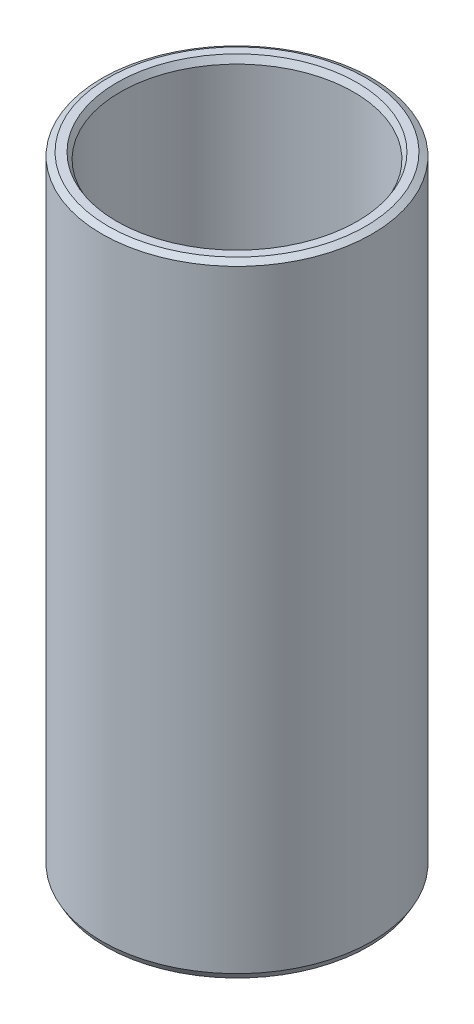
ISO-10303-21;
HEADER;
FILE_DESCRIPTION(('STEP AP214'),'2;1');
FILE_NAME('part.step','',(''),(''),'','','');
FILE_SCHEMA(('AUTOMOTIVE_DESIGN { 1 0 10303 214 1 1 1 1 }'));
ENDSEC;
DATA;
#1=APPLICATION_CONTEXT('core data for automotive mechanical design processes');
#2=APPLICATION_PROTOCOL_DEFINITION('international standard','automotive_design',2000,#1);
#3=PRODUCT_CONTEXT('',#1,'mechanical');
#4=PRODUCT('Part','Part','',(#3));
#5=PRODUCT_RELATED_PRODUCT_CATEGORY('part','',(#4));
#6=PRODUCT_DEFINITION_FORMATION('','',#4);
#7=PRODUCT_DEFINITION_CONTEXT('part definition',#1,'design');
#8=PRODUCT_DEFINITION('design','',#6,#7);
#9=PRODUCT_DEFINITION_SHAPE('','',#8);
#10=(LENGTH_UNIT() NAMED_UNIT(*) SI_UNIT(.MILLI.,.METRE.));
#11=(NAMED_UNIT(*) PLANE_ANGLE_UNIT() SI_UNIT($,.RADIAN.));
#12=(NAMED_UNIT(*) SI_UNIT($,.STERADIAN.) SOLID_ANGLE_UNIT());
#13=UNCERTAINTY_MEASURE_WITH_UNIT(LENGTH_MEASURE(1.E-05),#10,'distance_accuracy_value','');
#14=(GEOMETRIC_REPRESENTATION_CONTEXT(3) GLOBAL_UNCERTAINTY_ASSIGNED_CONTEXT((#13)) GLOBAL_UNIT_ASSIGNED_CONTEXT((#10,
#11,#12)) REPRESENTATION_CONTEXT('',''));
#15=CARTESIAN_POINT('',(0.,0.,0.));
#16=DIRECTION('',(0.,0.,1.));
#17=DIRECTION('',(1.,0.,0.));
#18=AXIS2_PLACEMENT_3D('',#15,#16,#17);
#19=CARTESIAN_POINT('',(0.,218.951031632617,0.));
#20=DIRECTION('',(0.,-1.,0.));
#21=DIRECTION('',(0.,0.,-1.));
#22=AXIS2_PLACEMENT_3D('',#19,#20,#21);
#23=CYLINDRICAL_SURFACE('',#22,47.5);
#24=CARTESIAN_POINT('',(0.,2.22806043817905,0.));
#25=DIRECTION('',(0.,1.,0.));
#26=DIRECTION('',(0.,0.,1.));
#27=AXIS2_PLACEMENT_3D('',#24,#25,#26);
#28=CIRCLE('',#27,47.5);
#29=CARTESIAN_POINT('',(0.,2.22806043817905,47.5));
#30=VERTEX_POINT('',#29);
#31=EDGE_CURVE('E10',#30,#30,#28,.T.);
#32=ORIENTED_EDGE('',*,*,#31,.T.);
#33=EDGE_LOOP('',(#32));
#34=FACE_BOUND('',#33,.T.);
#35=CARTESIAN_POINT('',(0.,217.694874571882,0.));
#36=DIRECTION('',(0.,1.,0.));
#37=DIRECTION('',(0.,0.,1.));
#38=AXIS2_PLACEMENT_3D('',#35,#36,#37);
#39=CIRCLE('',#38,47.5);
#40=CARTESIAN_POINT('',(0.,217.694874571882,47.5));
#41=VERTEX_POINT('',#40);
#42=EDGE_CURVE('E50',#41,#41,#39,.F.);
#43=ORIENTED_EDGE('',*,*,#42,.T.);
#44=EDGE_LOOP('',(#43));
#45=FACE_BOUND('',#44,.T.);
#46=ADVANCED_FACE('F39',(#34,#45),#23,.T.);
#47=CARTESIAN_POINT('',(0.,218.951031632617,0.));
#48=DIRECTION('',(0.,1.,0.));
#49=DIRECTION('',(0.,0.,1.));
#50=AXIS2_PLACEMENT_3D('',#47,#48,#49);
#51=PLANE('',#50);
#52=CARTESIAN_POINT('',(0.,218.951031632617,0.));
#53=DIRECTION('',(0.,1.,0.));
#54=DIRECTION('',(0.,0.,1.));
#55=AXIS2_PLACEMENT_3D('',#52,#53,#54);
#56=CIRCLE('',#55,42.2905381855113);
#57=CARTESIAN_POINT('',(0.,218.951031632617,42.2905381855113));
#58=VERTEX_POINT('',#57);
#59=EDGE_CURVE('E58',#58,#58,#56,.F.);
#60=ORIENTED_EDGE('',*,*,#59,.T.);
#61=EDGE_LOOP('',(#60));
#62=FACE_BOUND('',#61,.T.);
#63=CARTESIAN_POINT('',(0.,218.951031632617,0.));
#64=DIRECTION('',(0.,1.,0.));
#65=DIRECTION('',(0.,0.,1.));
#66=AXIS2_PLACEMENT_3D('',#63,#64,#65);
#67=CIRCLE('',#66,45.271939561821);
#68=CARTESIAN_POINT('',(0.,218.951031632617,45.271939561821));
#69=VERTEX_POINT('',#68);
#70=EDGE_CURVE('E61',#69,#69,#67,.T.);
#71=ORIENTED_EDGE('',*,*,#70,.T.);
#72=EDGE_LOOP('',(#71));
#73=FACE_BOUND('',#72,.T.);
#74=ADVANCED_FACE('F88',(#62,#73),#51,.T.);
#75=CARTESIAN_POINT('',(0.,0.,0.));
#76=DIRECTION('',(0.,1.,0.));
#77=DIRECTION('',(0.,0.,1.));
#78=AXIS2_PLACEMENT_3D('',#75,#76,#77);
#79=PLANE('',#78);
#80=CARTESIAN_POINT('',(0.,0.,0.));
#81=DIRECTION('',(0.,1.,0.));
#82=DIRECTION('',(0.,0.,1.));
#83=AXIS2_PLACEMENT_3D('',#80,#81,#82);
#84=CIRCLE('',#83,43.2624415629553);
#85=CARTESIAN_POINT('',(0.,0.,43.2624415629553));
#86=VERTEX_POINT('',#85);
#87=EDGE_CURVE('E51',#86,#86,#84,.T.);
#88=ORIENTED_EDGE('',*,*,#87,.T.);
#89=EDGE_LOOP('',(#88));
#90=FACE_BOUND('',#89,.T.);
#91=CARTESIAN_POINT('',(0.,0.,0.));
#92=DIRECTION('',(0.,1.,0.));
#93=DIRECTION('',(0.,0.,1.));
#94=AXIS2_PLACEMENT_3D('',#91,#92,#93);
#95=CIRCLE('',#94,46.2438429392649);
#96=CARTESIAN_POINT('',(0.,0.,46.2438429392649));
#97=VERTEX_POINT('',#96);
#98=EDGE_CURVE('E54',#97,#97,#95,.F.);
#99=ORIENTED_EDGE('',*,*,#98,.T.);
#100=EDGE_LOOP('',(#99));
#101=FACE_BOUND('',#100,.T.);
#102=ADVANCED_FACE('F83',(#90,#101),#79,.F.);
#103=CARTESIAN_POINT('',(0.,218.951031632617,0.));
#104=DIRECTION('',(0.,-1.,0.));
#105=DIRECTION('',(0.,0.,-1.));
#106=AXIS2_PLACEMENT_3D('',#103,#104,#105);
#107=CYLINDRICAL_SURFACE('',#106,41.0343811247763);
#108=CARTESIAN_POINT('',(0.,216.722971194438,0.));
#109=DIRECTION('',(0.,1.,0.));
#110=DIRECTION('',(0.,0.,1.));
#111=AXIS2_PLACEMENT_3D('',#108,#109,#110);
#112=CIRCLE('',#111,41.0343811247763);
#113=CARTESIAN_POINT('',(0.,216.722971194438,41.0343811247763));
#114=VERTEX_POINT('',#113);
#115=EDGE_CURVE('E67',#114,#114,#112,.T.);
#116=ORIENTED_EDGE('',*,*,#115,.T.);
#117=EDGE_LOOP('',(#116));
#118=FACE_BOUND('',#117,.T.);
#119=CARTESIAN_POINT('',(0.,1.25615706073506,0.));
#120=DIRECTION('',(0.,1.,0.));
#121=DIRECTION('',(0.,0.,1.));
#122=AXIS2_PLACEMENT_3D('',#119,#120,#121);
#123=CIRCLE('',#122,41.0343811247763);
#124=CARTESIAN_POINT('',(0.,1.25615706073506,41.0343811247763));
#125=VERTEX_POINT('',#124);
#126=EDGE_CURVE('E69',#125,#125,#123,.F.);
#127=ORIENTED_EDGE('',*,*,#126,.T.);
#128=EDGE_LOOP('',(#127));
#129=FACE_BOUND('',#128,.T.);
#130=ADVANCED_FACE('F71',(#118,#129),#107,.F.);
#131=CARTESIAN_POINT('',(0.,216.722971194438,0.));
#132=DIRECTION('',(0.,1.,0.));
#133=DIRECTION('',(0.,0.,1.));
#134=AXIS2_PLACEMENT_3D('',#131,#132,#133);
#135=CONICAL_SURFACE('',#134,41.0343811247763,0.513368474684208);
#136=ORIENTED_EDGE('',*,*,#59,.F.);
#137=EDGE_LOOP('',(#136));
#138=FACE_BOUND('',#137,.T.);
#139=ORIENTED_EDGE('',*,*,#115,.F.);
#140=EDGE_LOOP('',(#139));
#141=FACE_BOUND('',#140,.T.);
#142=ADVANCED_FACE('F77',(#138,#141),#135,.F.);
#143=CARTESIAN_POINT('',(0.,0.,0.));
#144=DIRECTION('',(0.,-1.,0.));
#145=DIRECTION('',(0.,0.,-1.));
#146=AXIS2_PLACEMENT_3D('',#143,#144,#145);
#147=CONICAL_SURFACE('',#146,43.2624415629553,1.05742785211069);
#148=ORIENTED_EDGE('',*,*,#126,.F.);
#149=EDGE_LOOP('',(#148));
#150=FACE_BOUND('',#149,.T.);
#151=ORIENTED_EDGE('',*,*,#87,.F.);
#152=EDGE_LOOP('',(#151));
#153=FACE_BOUND('',#152,.T.);
#154=ADVANCED_FACE('F73',(#150,#153),#147,.F.);
#155=CARTESIAN_POINT('',(0.,2.22806043817905,0.));
#156=DIRECTION('',(0.,1.,0.));
#157=DIRECTION('',(0.,0.,1.));
#158=AXIS2_PLACEMENT_3D('',#155,#156,#157);
#159=CONICAL_SURFACE('',#158,47.5,0.51336847468421);
#160=CARTESIAN_POINT('',(0.,0.,46.2438429392649));
#161=CARTESIAN_POINT('',(0.,0.0232089628976994,46.2569279086476));
#162=CARTESIAN_POINT('',(0.,0.0464179257953974,46.2700128780302));
#163=CARTESIAN_POINT('',(0.,0.0928358515907935,46.2961828167956));
#164=CARTESIAN_POINT('',(0.,0.116044814488491,46.3092677861782));
#165=CARTESIAN_POINT('',(0.,0.162462740283888,46.3354377249435));
#166=CARTESIAN_POINT('',(0.,0.185671703181587,46.3485226943262));
#167=CARTESIAN_POINT('',(0.,0.232089628976984,46.3746926330915));
#168=CARTESIAN_POINT('',(0.,0.255298591874683,46.3877776024742));
#169=CARTESIAN_POINT('',(0.,0.30171651767008,46.4139475412395));
#170=CARTESIAN_POINT('',(0.,0.324925480567778,46.4270325106221));
#171=CARTESIAN_POINT('',(0.,0.371343406363174,46.4532024493874));
#172=CARTESIAN_POINT('',(0.,0.394552369260873,46.4662874187701));
#173=CARTESIAN_POINT('',(0.,0.440970295056271,46.4924573575354));
#174=CARTESIAN_POINT('',(0.,0.464179257953969,46.5055423269181));
#175=CARTESIAN_POINT('',(0.,0.510597183749366,46.5317122656834));
#176=CARTESIAN_POINT('',(0.,0.533806146647064,46.544797235066));
#177=CARTESIAN_POINT('',(0.,0.58022407244246,46.5709671738314));
#178=CARTESIAN_POINT('',(0.,0.603433035340159,46.584052143214));
#179=CARTESIAN_POINT('',(0.,0.649850961135557,46.6102220819793));
#180=CARTESIAN_POINT('',(0.,0.673059924033255,46.623307051362));
#181=CARTESIAN_POINT('',(0.,0.719477849828652,46.6494769901273));
#182=CARTESIAN_POINT('',(0.,0.74268681272635,46.66256195951));
#183=CARTESIAN_POINT('',(0.,0.789104738521746,46.6887318982753));
#184=CARTESIAN_POINT('',(0.,0.812313701419445,46.7018168676579));
#185=CARTESIAN_POINT('',(0.,0.858731627214843,46.7279868064232));
#186=CARTESIAN_POINT('',(0.,0.881940590112542,46.7410717758059));
#187=CARTESIAN_POINT('',(0.,0.928358515907938,46.7672417145712));
#188=CARTESIAN_POINT('',(0.,0.951567478805636,46.7803266839539));
#189=CARTESIAN_POINT('',(0.,0.997985404601033,46.8064966227192));
#190=CARTESIAN_POINT('',(0.,1.02119436749873,46.8195815921018));
#191=CARTESIAN_POINT('',(0.,1.06761229329413,46.8457515308671));
#192=CARTESIAN_POINT('',(0.,1.09082125619183,46.8588365002498));
#193=CARTESIAN_POINT('',(0.,1.13723918198722,46.8850064390151));
#194=CARTESIAN_POINT('',(0.,1.16044814488492,46.8980914083978));
#195=CARTESIAN_POINT('',(0.,1.20686607068032,46.9242613471631));
#196=CARTESIAN_POINT('',(0.,1.23007503357802,46.9373463165457));
#197=CARTESIAN_POINT('',(0.,1.27649295937342,46.9635162553111));
#198=CARTESIAN_POINT('',(0.,1.29970192227111,46.9766012246937));
#199=CARTESIAN_POINT('',(0.,1.34611984806651,47.002771163459));
#200=CARTESIAN_POINT('',(0.,1.36932881096421,47.0158561328417));
#201=CARTESIAN_POINT('',(0.,1.41574673675961,47.042026071607));
#202=CARTESIAN_POINT('',(0.,1.4389556996573,47.0551110409897));
#203=CARTESIAN_POINT('',(0.,1.4853736254527,47.081280979755));
#204=CARTESIAN_POINT('',(0.,1.5085825883504,47.0943659491376));
#205=CARTESIAN_POINT('',(0.,1.5550005141458,47.120535887903));
#206=CARTESIAN_POINT('',(0.,1.57820947704349,47.1336208572856));
#207=CARTESIAN_POINT('',(0.,1.62462740283889,47.1597907960509));
#208=CARTESIAN_POINT('',(0.,1.64783636573659,47.1728757654336));
#209=CARTESIAN_POINT('',(0.,1.69425429153199,47.1990457041989));
#210=CARTESIAN_POINT('',(0.,1.71746325442969,47.2121306735815));
#211=CARTESIAN_POINT('',(0.,1.76388118022508,47.2383006123469));
#212=CARTESIAN_POINT('',(0.,1.78709014312278,47.2513855817295));
#213=CARTESIAN_POINT('',(0.,1.83350806891818,47.2775555204948));
#214=CARTESIAN_POINT('',(0.,1.85671703181588,47.2906404898775));
#215=CARTESIAN_POINT('',(0.,1.90313495761127,47.3168104286428));
#216=CARTESIAN_POINT('',(0.,1.92634392050897,47.3298953980255));
#217=CARTESIAN_POINT('',(0.,1.97276184630437,47.3560653367908));
#218=CARTESIAN_POINT('',(0.,1.99597080920207,47.3691503061734));
#219=CARTESIAN_POINT('',(0.,2.04238873499746,47.3953202449387));
#220=CARTESIAN_POINT('',(0.,2.06559769789516,47.4084052143214));
#221=CARTESIAN_POINT('',(0.,2.11201562369056,47.4345751530867));
#222=CARTESIAN_POINT('',(0.,2.13522458658826,47.4476601224694));
#223=CARTESIAN_POINT('',(0.,2.18164251238365,47.4738300612347));
#224=CARTESIAN_POINT('',(0.,2.20485147528135,47.4869150306174));
#225=CARTESIAN_POINT('',(0.,2.22806043817905,47.5));
#226=B_SPLINE_CURVE_WITH_KNOTS('',3,(#160,#161,#162,#163,#164,#165,#166,#167,#168,#169,#170,
#171,#172,#173,#174,#175,#176,#177,#178,#179,#180,#181,#182,#183,#184,#185,#186,#187,#188,#189,
#190,#191,#192,#193,#194,#195,#196,#197,#198,#199,#200,#201,#202,#203,#204,#205,#206,#207,#208,
#209,#210,#211,#212,#213,#214,#215,#216,#217,#218,#219,#220,#221,#222,#223,#224,#225),
.UNSPECIFIED.,.F.,.F.,(4,2,2,2,2,2,2,2,2,2,2,2,2,2,2,2,2,2,2,2,2,2,2,2,2,2,2,2,2,2,2,2,4),(0.,
0.0799302911466371,0.159860582293278,0.239790873439915,0.319721164586552,0.399651455733192,
0.479581746879829,0.559512038026467,0.639442329173107,0.719372620319744,0.799302911466381,
0.879233202613022,0.959163493759659,1.0390937849063,1.11902407605294,1.19895436719957,
1.27888465834621,1.35881494949285,1.43874524063949,1.51867553178613,1.59860582293277,
1.6785361140794,1.75846640522604,1.83839669637268,1.91832698751932,1.99825727866596,
2.0781875698126,2.15811786095923,2.23804815210587,2.31797844325251,2.39790873439915,
2.47783902554579,2.55776931669243),.UNSPECIFIED.);
#227=EDGE_CURVE('BSEAM76',#97,#30,#226,.T.);
#228=ORIENTED_EDGE('',*,*,#98,.F.);
#229=ORIENTED_EDGE('',*,*,#31,.F.);
#230=ORIENTED_EDGE('',*,*,#227,.T.);
#231=ORIENTED_EDGE('',*,*,#227,.F.);
#232=EDGE_LOOP('',(#228,#230,#229,#231));
#233=FACE_BOUND('',#232,.T.);
#234=ADVANCED_FACE('F76',(#233),#159,.T.);
#235=CARTESIAN_POINT('',(0.,218.951031632617,0.));
#236=DIRECTION('',(0.,-1.,0.));
#237=DIRECTION('',(0.,0.,-1.));
#238=AXIS2_PLACEMENT_3D('',#235,#236,#237);
#239=CONICAL_SURFACE('',#238,45.271939561821,1.05742785211069);
#240=ORIENTED_EDGE('',*,*,#42,.F.);
#241=EDGE_LOOP('',(#240));
#242=FACE_BOUND('',#241,.T.);
#243=ORIENTED_EDGE('',*,*,#70,.F.);
#244=EDGE_LOOP('',(#243));
#245=FACE_BOUND('',#244,.T.);
#246=ADVANCED_FACE('F45',(#242,#245),#239,.T.);
#247=CLOSED_SHELL('',(#46,#74,#102,#130,#142,#154,#234,#246));
#248=MANIFOLD_SOLID_BREP('B2',#247);
#249=ADVANCED_BREP_SHAPE_REPRESENTATION('',(#18,#248),#14);
#250=SHAPE_DEFINITION_REPRESENTATION(#9,#249);
ENDSEC;
END-ISO-10303-21;
